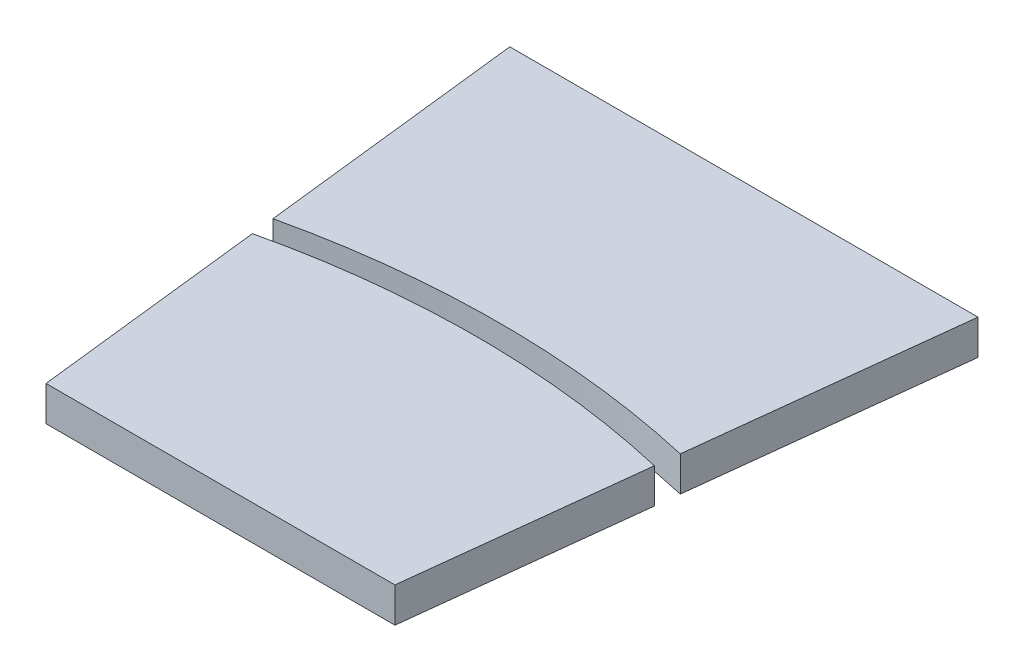
ISO-10303-21;
HEADER;
FILE_DESCRIPTION(('STEP AP214'),'2;1');
FILE_NAME('part.step','',(''),(''),'','','');
FILE_SCHEMA(('AUTOMOTIVE_DESIGN { 1 0 10303 214 1 1 1 1 }'));
ENDSEC;
DATA;
#1=APPLICATION_CONTEXT('core data for automotive mechanical design processes');
#2=APPLICATION_PROTOCOL_DEFINITION('international standard','automotive_design',2000,#1);
#3=PRODUCT_CONTEXT('',#1,'mechanical');
#4=PRODUCT('Part','Part','',(#3));
#5=PRODUCT_RELATED_PRODUCT_CATEGORY('part','',(#4));
#6=PRODUCT_DEFINITION_FORMATION('','',#4);
#7=PRODUCT_DEFINITION_CONTEXT('part definition',#1,'design');
#8=PRODUCT_DEFINITION('design','',#6,#7);
#9=PRODUCT_DEFINITION_SHAPE('','',#8);
#10=(LENGTH_UNIT() NAMED_UNIT(*) SI_UNIT(.MILLI.,.METRE.));
#11=(NAMED_UNIT(*) PLANE_ANGLE_UNIT() SI_UNIT($,.RADIAN.));
#12=(NAMED_UNIT(*) SI_UNIT($,.STERADIAN.) SOLID_ANGLE_UNIT());
#13=UNCERTAINTY_MEASURE_WITH_UNIT(LENGTH_MEASURE(1.E-05),#10,'distance_accuracy_value','');
#14=(GEOMETRIC_REPRESENTATION_CONTEXT(3) GLOBAL_UNCERTAINTY_ASSIGNED_CONTEXT((#13)) GLOBAL_UNIT_ASSIGNED_CONTEXT((#10,
#11,#12)) REPRESENTATION_CONTEXT('',''));
#15=CARTESIAN_POINT('',(0.,0.,0.));
#16=DIRECTION('',(0.,0.,1.));
#17=DIRECTION('',(1.,0.,0.));
#18=AXIS2_PLACEMENT_3D('',#15,#16,#17);
#19=CARTESIAN_POINT('',(-20.1271023735741,3.,-99.5));
#20=DIRECTION('',(0.993571855676587,0.,-0.113203213767907));
#21=DIRECTION('',(-0.113203213767907,0.,-0.993571855676588));
#22=AXIS2_PLACEMENT_3D('',#19,#20,#21);
#23=PLANE('',#22);
#24=DIRECTION('',(0.113203213767907,0.,0.993571855676588));
#25=VECTOR('',#24,1.);
#26=CARTESIAN_POINT('',(-20.1271023735741,3.,-99.5));
#27=LINE('',#26,#25);
#28=CARTESIAN_POINT('',(-17.2812790711249,3.,-74.5225294368481));
#29=VERTEX_POINT('',#28);
#30=CARTESIAN_POINT('',(-15.,3.,-54.5));
#31=VERTEX_POINT('',#30);
#32=EDGE_CURVE('E85',#29,#31,#27,.T.);
#33=ORIENTED_EDGE('',*,*,#32,.F.);
#34=DIRECTION('',(0.,1.,0.));
#35=VECTOR('',#34,1.);
#36=CARTESIAN_POINT('',(-17.2812790711249,0.,-74.5225294368482));
#37=LINE('',#36,#35);
#38=CARTESIAN_POINT('',(-17.2812790711249,0.,-74.5225294368482));
#39=VERTEX_POINT('',#38);
#40=EDGE_CURVE('E49',#39,#29,#37,.T.);
#41=ORIENTED_EDGE('',*,*,#40,.F.);
#42=DIRECTION('',(0.113203213767907,0.,0.993571855676588));
#43=VECTOR('',#42,1.);
#44=CARTESIAN_POINT('',(-20.1271023735741,0.,-99.5));
#45=LINE('',#44,#43);
#46=CARTESIAN_POINT('',(-15.,0.,-54.5));
#47=VERTEX_POINT('',#46);
#48=EDGE_CURVE('E77',#39,#47,#45,.T.);
#49=ORIENTED_EDGE('',*,*,#48,.T.);
#50=DIRECTION('',(0.,-1.,0.));
#51=VECTOR('',#50,1.);
#52=CARTESIAN_POINT('',(-15.,3.,-54.5));
#53=LINE('',#52,#51);
#54=EDGE_CURVE('E80',#31,#47,#53,.T.);
#55=ORIENTED_EDGE('',*,*,#54,.F.);
#56=EDGE_LOOP('',(#33,#41,#49,#55));
#57=FACE_BOUND('',#56,.T.);
#58=ADVANCED_FACE('F42',(#57),#23,.F.);
#59=CARTESIAN_POINT('',(0.,3.,0.));
#60=DIRECTION('',(0.,-1.,0.));
#61=DIRECTION('',(0.,0.,-1.));
#62=AXIS2_PLACEMENT_3D('',#59,#60,#61);
#63=PLANE('',#62);
#64=DIRECTION('',(-0.113203213767907,0.,0.993571855676588));
#65=VECTOR('',#64,1.);
#66=CARTESIAN_POINT('',(20.1271023735741,3.,-99.5));
#67=LINE('',#66,#65);
#68=CARTESIAN_POINT('',(17.2812790711249,3.,-74.5225294368481));
#69=VERTEX_POINT('',#68);
#70=CARTESIAN_POINT('',(15.,3.,-54.5));
#71=VERTEX_POINT('',#70);
#72=EDGE_CURVE('E101',#69,#71,#67,.T.);
#73=ORIENTED_EDGE('',*,*,#72,.F.);
#74=CARTESIAN_POINT('',(0.,3.,0.));
#75=DIRECTION('',(0.,1.,0.));
#76=DIRECTION('',(0.,0.,1.));
#77=AXIS2_PLACEMENT_3D('',#74,#75,#76);
#78=CIRCLE('',#77,76.5);
#79=EDGE_CURVE('E12',#29,#69,#78,.F.);
#80=ORIENTED_EDGE('',*,*,#79,.F.);
#81=ORIENTED_EDGE('',*,*,#32,.T.);
#82=DIRECTION('',(1.,0.,0.));
#83=VECTOR('',#82,1.);
#84=CARTESIAN_POINT('',(0.,3.,-54.5));
#85=LINE('',#84,#83);
#86=EDGE_CURVE('E94',#31,#71,#85,.T.);
#87=ORIENTED_EDGE('',*,*,#86,.T.);
#88=EDGE_LOOP('',(#73,#80,#81,#87));
#89=FACE_BOUND('',#88,.T.);
#90=ADVANCED_FACE('F115',(#89),#63,.F.);
#91=CARTESIAN_POINT('',(0.,0.,0.));
#92=DIRECTION('',(0.,-1.,0.));
#93=DIRECTION('',(0.,0.,-1.));
#94=AXIS2_PLACEMENT_3D('',#91,#92,#93);
#95=PLANE('',#94);
#96=CARTESIAN_POINT('',(0.,0.,0.));
#97=DIRECTION('',(0.,-1.,0.));
#98=DIRECTION('',(0.,0.,-1.));
#99=AXIS2_PLACEMENT_3D('',#96,#97,#98);
#100=CIRCLE('',#99,76.5);
#101=CARTESIAN_POINT('',(17.2812790711249,0.,-74.5225294368482));
#102=VERTEX_POINT('',#101);
#103=EDGE_CURVE('E104',#39,#102,#100,.T.);
#104=ORIENTED_EDGE('',*,*,#103,.T.);
#105=DIRECTION('',(-0.113203213767907,0.,0.993571855676588));
#106=VECTOR('',#105,1.);
#107=CARTESIAN_POINT('',(20.1271023735741,0.,-99.5));
#108=LINE('',#107,#106);
#109=CARTESIAN_POINT('',(15.,0.,-54.5));
#110=VERTEX_POINT('',#109);
#111=EDGE_CURVE('E98',#102,#110,#108,.T.);
#112=ORIENTED_EDGE('',*,*,#111,.T.);
#113=DIRECTION('',(1.,0.,0.));
#114=VECTOR('',#113,1.);
#115=CARTESIAN_POINT('',(0.,0.,-54.5));
#116=LINE('',#115,#114);
#117=EDGE_CURVE('E91',#47,#110,#116,.T.);
#118=ORIENTED_EDGE('',*,*,#117,.F.);
#119=ORIENTED_EDGE('',*,*,#48,.F.);
#120=EDGE_LOOP('',(#104,#112,#118,#119));
#121=FACE_BOUND('',#120,.T.);
#122=ADVANCED_FACE('F96',(#121),#95,.T.);
#123=CARTESIAN_POINT('',(20.1271023735741,3.,-99.5));
#124=DIRECTION('',(0.993571855676587,0.,0.113203213767907));
#125=DIRECTION('',(0.113203213767907,0.,-0.993571855676588));
#126=AXIS2_PLACEMENT_3D('',#123,#124,#125);
#127=PLANE('',#126);
#128=DIRECTION('',(0.,1.,0.));
#129=VECTOR('',#128,1.);
#130=CARTESIAN_POINT('',(17.2812790711249,0.,-74.5225294368482));
#131=LINE('',#130,#129);
#132=EDGE_CURVE('E106',#102,#69,#131,.T.);
#133=ORIENTED_EDGE('',*,*,#132,.T.);
#134=ORIENTED_EDGE('',*,*,#72,.T.);
#135=DIRECTION('',(0.,-1.,0.));
#136=VECTOR('',#135,1.);
#137=CARTESIAN_POINT('',(15.,3.,-54.5));
#138=LINE('',#137,#136);
#139=EDGE_CURVE('E99',#71,#110,#138,.T.);
#140=ORIENTED_EDGE('',*,*,#139,.T.);
#141=ORIENTED_EDGE('',*,*,#111,.F.);
#142=EDGE_LOOP('',(#133,#134,#140,#141));
#143=FACE_BOUND('',#142,.T.);
#144=ADVANCED_FACE('F113',(#143),#127,.T.);
#145=CARTESIAN_POINT('',(0.,3.,-54.5));
#146=DIRECTION('',(0.,0.,-1.));
#147=DIRECTION('',(-1.,0.,0.));
#148=AXIS2_PLACEMENT_3D('',#145,#146,#147);
#149=PLANE('',#148);
#150=ORIENTED_EDGE('',*,*,#117,.T.);
#151=ORIENTED_EDGE('',*,*,#139,.F.);
#152=ORIENTED_EDGE('',*,*,#86,.F.);
#153=ORIENTED_EDGE('',*,*,#54,.T.);
#154=EDGE_LOOP('',(#150,#151,#152,#153));
#155=FACE_BOUND('',#154,.T.);
#156=ADVANCED_FACE('F89',(#155),#149,.F.);
#157=CARTESIAN_POINT('',(0.,0.,0.));
#158=DIRECTION('',(0.,1.,0.));
#159=DIRECTION('',(0.,0.,1.));
#160=AXIS2_PLACEMENT_3D('',#157,#158,#159);
#161=CYLINDRICAL_SURFACE('',#160,76.5);
#162=ORIENTED_EDGE('',*,*,#132,.F.);
#163=ORIENTED_EDGE('',*,*,#103,.F.);
#164=ORIENTED_EDGE('',*,*,#40,.T.);
#165=ORIENTED_EDGE('',*,*,#79,.T.);
#166=EDGE_LOOP('',(#162,#163,#164,#165));
#167=FACE_BOUND('',#166,.T.);
#168=ADVANCED_FACE('F125',(#167),#161,.T.);
#169=CLOSED_SHELL('',(#58,#90,#122,#144,#156,#168));
#170=MANIFOLD_SOLID_BREP('B2',#169);
#171=CARTESIAN_POINT('',(-20.1271023735741,3.,-99.5));
#172=DIRECTION('',(0.,0.,1.));
#173=DIRECTION('',(1.,0.,0.));
#174=AXIS2_PLACEMENT_3D('',#171,#172,#173);
#175=PLANE('',#174);
#176=DIRECTION('',(-1.,0.,0.));
#177=VECTOR('',#176,1.);
#178=CARTESIAN_POINT('',(-20.1271023735741,0.,-99.5));
#179=LINE('',#178,#177);
#180=CARTESIAN_POINT('',(20.1271023735741,0.,-99.5));
#181=VERTEX_POINT('',#180);
#182=CARTESIAN_POINT('',(-20.1271023735741,0.,-99.5));
#183=VERTEX_POINT('',#182);
#184=EDGE_CURVE('E215',#181,#183,#179,.T.);
#185=ORIENTED_EDGE('',*,*,#184,.T.);
#186=DIRECTION('',(0.,-1.,0.));
#187=VECTOR('',#186,1.);
#188=CARTESIAN_POINT('',(-20.1271023735741,3.,-99.5));
#189=LINE('',#188,#187);
#190=CARTESIAN_POINT('',(-20.1271023735741,3.,-99.5));
#191=VERTEX_POINT('',#190);
#192=EDGE_CURVE('E40',#191,#183,#189,.T.);
#193=ORIENTED_EDGE('',*,*,#192,.F.);
#194=DIRECTION('',(-1.,0.,0.));
#195=VECTOR('',#194,1.);
#196=CARTESIAN_POINT('',(-20.1271023735741,3.,-99.5));
#197=LINE('',#196,#195);
#198=CARTESIAN_POINT('',(20.1271023735741,3.,-99.5));
#199=VERTEX_POINT('',#198);
#200=EDGE_CURVE('E228',#199,#191,#197,.T.);
#201=ORIENTED_EDGE('',*,*,#200,.F.);
#202=DIRECTION('',(0.,-1.,0.));
#203=VECTOR('',#202,1.);
#204=CARTESIAN_POINT('',(20.1271023735741,3.,-99.5));
#205=LINE('',#204,#203);
#206=EDGE_CURVE('E224',#199,#181,#205,.T.);
#207=ORIENTED_EDGE('',*,*,#206,.T.);
#208=EDGE_LOOP('',(#185,#193,#201,#207));
#209=FACE_BOUND('',#208,.T.);
#210=ADVANCED_FACE('F174',(#209),#175,.F.);
#211=CARTESIAN_POINT('',(20.1271023735741,3.,-99.5));
#212=DIRECTION('',(0.993571855676587,0.,0.113203213767907));
#213=DIRECTION('',(0.113203213767907,0.,-0.993571855676588));
#214=AXIS2_PLACEMENT_3D('',#211,#212,#213);
#215=PLANE('',#214);
#216=DIRECTION('',(0.,1.,0.));
#217=VECTOR('',#216,1.);
#218=CARTESIAN_POINT('',(17.5091373329901,0.,-76.5224157345708));
#219=LINE('',#218,#217);
#220=CARTESIAN_POINT('',(17.5091373329901,0.,-76.5224157345707));
#221=VERTEX_POINT('',#220);
#222=CARTESIAN_POINT('',(17.5091373329901,3.,-76.5224157345708));
#223=VERTEX_POINT('',#222);
#224=EDGE_CURVE('E200',#221,#223,#219,.T.);
#225=ORIENTED_EDGE('',*,*,#224,.F.);
#226=DIRECTION('',(-0.113203213767907,0.,0.993571855676588));
#227=VECTOR('',#226,1.);
#228=CARTESIAN_POINT('',(20.1271023735741,0.,-99.5));
#229=LINE('',#228,#227);
#230=EDGE_CURVE('E219',#181,#221,#229,.T.);
#231=ORIENTED_EDGE('',*,*,#230,.F.);
#232=ORIENTED_EDGE('',*,*,#206,.F.);
#233=DIRECTION('',(-0.113203213767907,0.,0.993571855676588));
#234=VECTOR('',#233,1.);
#235=CARTESIAN_POINT('',(20.1271023735741,3.,-99.5));
#236=LINE('',#235,#234);
#237=EDGE_CURVE('E232',#199,#223,#236,.T.);
#238=ORIENTED_EDGE('',*,*,#237,.T.);
#239=EDGE_LOOP('',(#225,#231,#232,#238));
#240=FACE_BOUND('',#239,.T.);
#241=ADVANCED_FACE('F234',(#240),#215,.T.);
#242=CARTESIAN_POINT('',(0.,0.,0.));
#243=DIRECTION('',(0.,-1.,0.));
#244=DIRECTION('',(0.,0.,-1.));
#245=AXIS2_PLACEMENT_3D('',#242,#243,#244);
#246=PLANE('',#245);
#247=CARTESIAN_POINT('',(0.,0.,0.));
#248=DIRECTION('',(0.,1.,0.));
#249=DIRECTION('',(0.,0.,-1.));
#250=AXIS2_PLACEMENT_3D('',#247,#248,#249);
#251=CIRCLE('',#250,78.5);
#252=CARTESIAN_POINT('',(-17.5091373329901,0.,-76.5224157345708));
#253=VERTEX_POINT('',#252);
#254=EDGE_CURVE('E191',#221,#253,#251,.T.);
#255=ORIENTED_EDGE('',*,*,#254,.T.);
#256=DIRECTION('',(0.113203213767907,0.,0.993571855676588));
#257=VECTOR('',#256,1.);
#258=CARTESIAN_POINT('',(-20.1271023735741,0.,-99.5));
#259=LINE('',#258,#257);
#260=EDGE_CURVE('E221',#183,#253,#259,.T.);
#261=ORIENTED_EDGE('',*,*,#260,.F.);
#262=ORIENTED_EDGE('',*,*,#184,.F.);
#263=ORIENTED_EDGE('',*,*,#230,.T.);
#264=EDGE_LOOP('',(#255,#261,#262,#263));
#265=FACE_BOUND('',#264,.T.);
#266=ADVANCED_FACE('F217',(#265),#246,.T.);
#267=CARTESIAN_POINT('',(0.,3.,0.));
#268=DIRECTION('',(0.,-1.,0.));
#269=DIRECTION('',(0.,0.,-1.));
#270=AXIS2_PLACEMENT_3D('',#267,#268,#269);
#271=PLANE('',#270);
#272=DIRECTION('',(0.113203213767907,0.,0.993571855676588));
#273=VECTOR('',#272,1.);
#274=CARTESIAN_POINT('',(-20.1271023735741,3.,-99.5));
#275=LINE('',#274,#273);
#276=CARTESIAN_POINT('',(-17.5091373329901,3.,-76.5224157345709));
#277=VERTEX_POINT('',#276);
#278=EDGE_CURVE('E183',#191,#277,#275,.T.);
#279=ORIENTED_EDGE('',*,*,#278,.T.);
#280=CARTESIAN_POINT('',(0.,3.,0.));
#281=DIRECTION('',(0.,1.,0.));
#282=DIRECTION('',(0.,0.,1.));
#283=AXIS2_PLACEMENT_3D('',#280,#281,#282);
#284=CIRCLE('',#283,78.5);
#285=EDGE_CURVE('E177',#223,#277,#284,.T.);
#286=ORIENTED_EDGE('',*,*,#285,.F.);
#287=ORIENTED_EDGE('',*,*,#237,.F.);
#288=ORIENTED_EDGE('',*,*,#200,.T.);
#289=EDGE_LOOP('',(#279,#286,#287,#288));
#290=FACE_BOUND('',#289,.T.);
#291=ADVANCED_FACE('F245',(#290),#271,.F.);
#292=CARTESIAN_POINT('',(-20.1271023735741,3.,-99.5));
#293=DIRECTION('',(0.993571855676587,0.,-0.113203213767907));
#294=DIRECTION('',(-0.113203213767907,0.,-0.993571855676588));
#295=AXIS2_PLACEMENT_3D('',#292,#293,#294);
#296=PLANE('',#295);
#297=ORIENTED_EDGE('',*,*,#260,.T.);
#298=DIRECTION('',(0.,1.,0.));
#299=VECTOR('',#298,1.);
#300=CARTESIAN_POINT('',(-17.5091373329901,0.,-76.5224157345708));
#301=LINE('',#300,#299);
#302=EDGE_CURVE('E205',#253,#277,#301,.T.);
#303=ORIENTED_EDGE('',*,*,#302,.T.);
#304=ORIENTED_EDGE('',*,*,#278,.F.);
#305=ORIENTED_EDGE('',*,*,#192,.T.);
#306=EDGE_LOOP('',(#297,#303,#304,#305));
#307=FACE_BOUND('',#306,.T.);
#308=ADVANCED_FACE('F243',(#307),#296,.F.);
#309=CARTESIAN_POINT('',(0.,0.,0.));
#310=DIRECTION('',(0.,1.,0.));
#311=DIRECTION('',(0.,0.,1.));
#312=AXIS2_PLACEMENT_3D('',#309,#310,#311);
#313=CYLINDRICAL_SURFACE('',#312,78.5);
#314=ORIENTED_EDGE('',*,*,#302,.F.);
#315=ORIENTED_EDGE('',*,*,#254,.F.);
#316=ORIENTED_EDGE('',*,*,#224,.T.);
#317=ORIENTED_EDGE('',*,*,#285,.T.);
#318=EDGE_LOOP('',(#314,#315,#316,#317));
#319=FACE_BOUND('',#318,.T.);
#320=ADVANCED_FACE('F246',(#319),#313,.F.);
#321=CLOSED_SHELL('',(#210,#241,#266,#291,#308,#320));
#322=MANIFOLD_SOLID_BREP('B6',#321);
#323=ADVANCED_BREP_SHAPE_REPRESENTATION('',(#18,#170,#322),#14);
#324=SHAPE_DEFINITION_REPRESENTATION(#9,#323);
ENDSEC;
END-ISO-10303-21;
